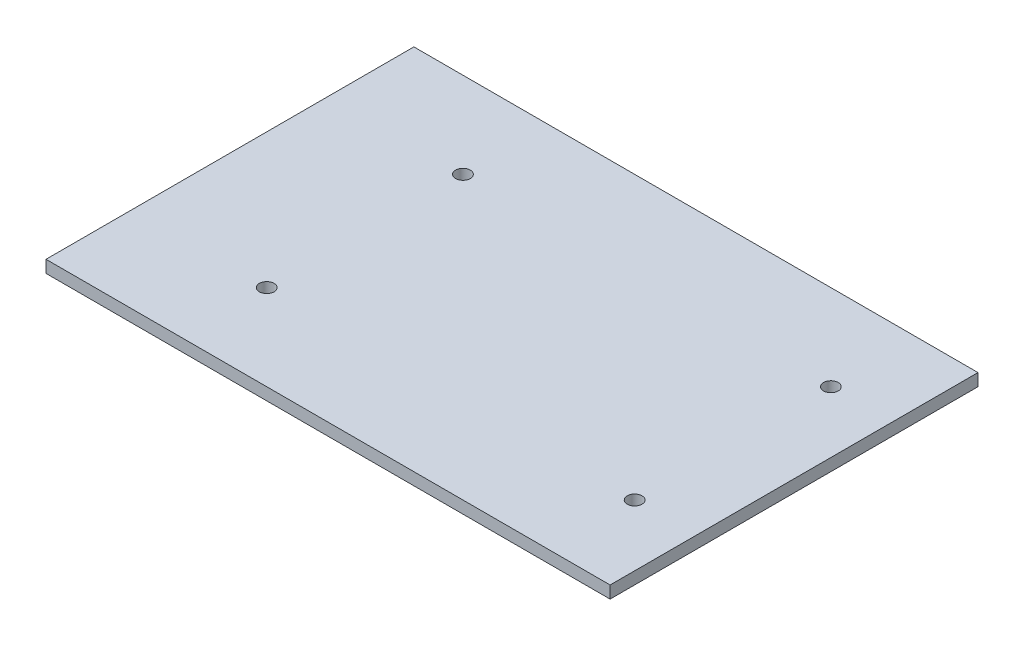
ISO-10303-21;
HEADER;
FILE_DESCRIPTION(('STEP AP214'),'2;1');
FILE_NAME('part.step','',(''),(''),'','','');
FILE_SCHEMA(('AUTOMOTIVE_DESIGN { 1 0 10303 214 1 1 1 1 }'));
ENDSEC;
DATA;
#1=APPLICATION_CONTEXT('core data for automotive mechanical design processes');
#2=APPLICATION_PROTOCOL_DEFINITION('international standard','automotive_design',2000,#1);
#3=PRODUCT_CONTEXT('',#1,'mechanical');
#4=PRODUCT('Part','Part','',(#3));
#5=PRODUCT_RELATED_PRODUCT_CATEGORY('part','',(#4));
#6=PRODUCT_DEFINITION_FORMATION('','',#4);
#7=PRODUCT_DEFINITION_CONTEXT('part definition',#1,'design');
#8=PRODUCT_DEFINITION('design','',#6,#7);
#9=PRODUCT_DEFINITION_SHAPE('','',#8);
#10=(LENGTH_UNIT() NAMED_UNIT(*) SI_UNIT(.MILLI.,.METRE.));
#11=(NAMED_UNIT(*) PLANE_ANGLE_UNIT() SI_UNIT($,.RADIAN.));
#12=(NAMED_UNIT(*) SI_UNIT($,.STERADIAN.) SOLID_ANGLE_UNIT());
#13=UNCERTAINTY_MEASURE_WITH_UNIT(LENGTH_MEASURE(1.E-05),#10,'distance_accuracy_value','');
#14=(GEOMETRIC_REPRESENTATION_CONTEXT(3) GLOBAL_UNCERTAINTY_ASSIGNED_CONTEXT((#13)) GLOBAL_UNIT_ASSIGNED_CONTEXT((#10,
#11,#12)) REPRESENTATION_CONTEXT('',''));
#15=CARTESIAN_POINT('',(0.,0.,0.));
#16=DIRECTION('',(0.,0.,1.));
#17=DIRECTION('',(1.,0.,0.));
#18=AXIS2_PLACEMENT_3D('',#15,#16,#17);
#19=CARTESIAN_POINT('',(0.,5.,0.));
#20=DIRECTION('',(1.,0.,0.));
#21=DIRECTION('',(0.,0.,-1.));
#22=AXIS2_PLACEMENT_3D('',#19,#20,#21);
#23=PLANE('',#22);
#24=DIRECTION('',(0.,0.,1.));
#25=VECTOR('',#24,1.);
#26=CARTESIAN_POINT('',(0.,0.,0.));
#27=LINE('',#26,#25);
#28=CARTESIAN_POINT('',(0.,0.,-150.));
#29=VERTEX_POINT('',#28);
#30=CARTESIAN_POINT('',(0.,0.,0.));
#31=VERTEX_POINT('',#30);
#32=EDGE_CURVE('E111',#29,#31,#27,.T.);
#33=ORIENTED_EDGE('',*,*,#32,.T.);
#34=DIRECTION('',(0.,-1.,0.));
#35=VECTOR('',#34,1.);
#36=CARTESIAN_POINT('',(0.,5.,0.));
#37=LINE('',#36,#35);
#38=CARTESIAN_POINT('',(0.,5.,0.));
#39=VERTEX_POINT('',#38);
#40=EDGE_CURVE('E11',#39,#31,#37,.T.);
#41=ORIENTED_EDGE('',*,*,#40,.F.);
#42=DIRECTION('',(0.,0.,1.));
#43=VECTOR('',#42,1.);
#44=CARTESIAN_POINT('',(0.,5.,0.));
#45=LINE('',#44,#43);
#46=CARTESIAN_POINT('',(0.,5.,-150.));
#47=VERTEX_POINT('',#46);
#48=EDGE_CURVE('E94',#47,#39,#45,.T.);
#49=ORIENTED_EDGE('',*,*,#48,.F.);
#50=DIRECTION('',(0.,-1.,0.));
#51=VECTOR('',#50,1.);
#52=CARTESIAN_POINT('',(0.,5.,-150.));
#53=LINE('',#52,#51);
#54=EDGE_CURVE('E107',#47,#29,#53,.T.);
#55=ORIENTED_EDGE('',*,*,#54,.T.);
#56=EDGE_LOOP('',(#33,#41,#49,#55));
#57=FACE_BOUND('',#56,.T.);
#58=ADVANCED_FACE('F40',(#57),#23,.F.);
#59=CARTESIAN_POINT('',(0.,5.,0.));
#60=DIRECTION('',(0.,0.,-1.));
#61=DIRECTION('',(-1.,0.,0.));
#62=AXIS2_PLACEMENT_3D('',#59,#60,#61);
#63=PLANE('',#62);
#64=DIRECTION('',(1.,0.,0.));
#65=VECTOR('',#64,1.);
#66=CARTESIAN_POINT('',(0.,0.,0.));
#67=LINE('',#66,#65);
#68=CARTESIAN_POINT('',(230.,0.,0.));
#69=VERTEX_POINT('',#68);
#70=EDGE_CURVE('E99',#31,#69,#67,.T.);
#71=ORIENTED_EDGE('',*,*,#70,.T.);
#72=DIRECTION('',(0.,-1.,0.));
#73=VECTOR('',#72,1.);
#74=CARTESIAN_POINT('',(230.,5.,0.));
#75=LINE('',#74,#73);
#76=CARTESIAN_POINT('',(230.,5.,0.));
#77=VERTEX_POINT('',#76);
#78=EDGE_CURVE('E50',#77,#69,#75,.T.);
#79=ORIENTED_EDGE('',*,*,#78,.F.);
#80=DIRECTION('',(1.,0.,0.));
#81=VECTOR('',#80,1.);
#82=CARTESIAN_POINT('',(0.,5.,0.));
#83=LINE('',#82,#81);
#84=EDGE_CURVE('E89',#39,#77,#83,.T.);
#85=ORIENTED_EDGE('',*,*,#84,.F.);
#86=ORIENTED_EDGE('',*,*,#40,.T.);
#87=EDGE_LOOP('',(#71,#79,#85,#86));
#88=FACE_BOUND('',#87,.T.);
#89=ADVANCED_FACE('F98',(#88),#63,.F.);
#90=CARTESIAN_POINT('',(230.,5.,0.));
#91=DIRECTION('',(-1.,0.,0.));
#92=DIRECTION('',(0.,0.,1.));
#93=AXIS2_PLACEMENT_3D('',#90,#91,#92);
#94=PLANE('',#93);
#95=DIRECTION('',(0.,0.,-1.));
#96=VECTOR('',#95,1.);
#97=CARTESIAN_POINT('',(230.,0.,0.));
#98=LINE('',#97,#96);
#99=CARTESIAN_POINT('',(230.,0.,-150.));
#100=VERTEX_POINT('',#99);
#101=EDGE_CURVE('E76',#69,#100,#98,.T.);
#102=ORIENTED_EDGE('',*,*,#101,.T.);
#103=DIRECTION('',(0.,-1.,0.));
#104=VECTOR('',#103,1.);
#105=CARTESIAN_POINT('',(230.,5.,-150.));
#106=LINE('',#105,#104);
#107=CARTESIAN_POINT('',(230.,5.,-150.));
#108=VERTEX_POINT('',#107);
#109=EDGE_CURVE('E101',#108,#100,#106,.T.);
#110=ORIENTED_EDGE('',*,*,#109,.F.);
#111=DIRECTION('',(0.,0.,-1.));
#112=VECTOR('',#111,1.);
#113=CARTESIAN_POINT('',(230.,5.,0.));
#114=LINE('',#113,#112);
#115=EDGE_CURVE('E92',#77,#108,#114,.T.);
#116=ORIENTED_EDGE('',*,*,#115,.F.);
#117=ORIENTED_EDGE('',*,*,#78,.T.);
#118=EDGE_LOOP('',(#102,#110,#116,#117));
#119=FACE_BOUND('',#118,.T.);
#120=ADVANCED_FACE('F103',(#119),#94,.F.);
#121=CARTESIAN_POINT('',(0.,5.,-150.));
#122=DIRECTION('',(0.,0.,1.));
#123=DIRECTION('',(1.,0.,0.));
#124=AXIS2_PLACEMENT_3D('',#121,#122,#123);
#125=PLANE('',#124);
#126=DIRECTION('',(-1.,0.,0.));
#127=VECTOR('',#126,1.);
#128=CARTESIAN_POINT('',(0.,0.,-150.));
#129=LINE('',#128,#127);
#130=EDGE_CURVE('E82',#100,#29,#129,.T.);
#131=ORIENTED_EDGE('',*,*,#130,.T.);
#132=ORIENTED_EDGE('',*,*,#54,.F.);
#133=DIRECTION('',(-1.,0.,0.));
#134=VECTOR('',#133,1.);
#135=CARTESIAN_POINT('',(0.,5.,-150.));
#136=LINE('',#135,#134);
#137=EDGE_CURVE('E59',#108,#47,#136,.T.);
#138=ORIENTED_EDGE('',*,*,#137,.F.);
#139=ORIENTED_EDGE('',*,*,#109,.T.);
#140=EDGE_LOOP('',(#131,#132,#138,#139));
#141=FACE_BOUND('',#140,.T.);
#142=ADVANCED_FACE('F164',(#141),#125,.F.);
#143=CARTESIAN_POINT('',(0.,5.,0.));
#144=DIRECTION('',(0.,-1.,0.));
#145=DIRECTION('',(0.,0.,-1.));
#146=AXIS2_PLACEMENT_3D('',#143,#144,#145);
#147=PLANE('',#146);
#148=CARTESIAN_POINT('',(55.,5.,-115.));
#149=DIRECTION('',(0.,1.,0.));
#150=DIRECTION('',(0.,0.,1.));
#151=AXIS2_PLACEMENT_3D('',#148,#149,#150);
#152=CIRCLE('',#151,3.);
#153=CARTESIAN_POINT('',(55.,5.,-112.));
#154=VERTEX_POINT('',#153);
#155=EDGE_CURVE('E128',#154,#154,#152,.T.);
#156=ORIENTED_EDGE('',*,*,#155,.F.);
#157=EDGE_LOOP('',(#156));
#158=FACE_BOUND('',#157,.T.);
#159=CARTESIAN_POINT('',(55.,5.,-35.));
#160=DIRECTION('',(0.,1.,0.));
#161=DIRECTION('',(0.,0.,1.));
#162=AXIS2_PLACEMENT_3D('',#159,#160,#161);
#163=CIRCLE('',#162,3.);
#164=CARTESIAN_POINT('',(55.,5.,-32.));
#165=VERTEX_POINT('',#164);
#166=EDGE_CURVE('E136',#165,#165,#163,.T.);
#167=ORIENTED_EDGE('',*,*,#166,.F.);
#168=EDGE_LOOP('',(#167));
#169=FACE_BOUND('',#168,.T.);
#170=CARTESIAN_POINT('',(205.,5.,-35.));
#171=DIRECTION('',(0.,1.,0.));
#172=DIRECTION('',(0.,0.,1.));
#173=AXIS2_PLACEMENT_3D('',#170,#171,#172);
#174=CIRCLE('',#173,2.99999999999999);
#175=CARTESIAN_POINT('',(205.,5.,-32.));
#176=VERTEX_POINT('',#175);
#177=EDGE_CURVE('E147',#176,#176,#174,.T.);
#178=ORIENTED_EDGE('',*,*,#177,.F.);
#179=EDGE_LOOP('',(#178));
#180=FACE_BOUND('',#179,.T.);
#181=CARTESIAN_POINT('',(205.,5.,-115.));
#182=DIRECTION('',(0.,1.,0.));
#183=DIRECTION('',(0.,0.,1.));
#184=AXIS2_PLACEMENT_3D('',#181,#182,#183);
#185=CIRCLE('',#184,2.99999999999999);
#186=CARTESIAN_POINT('',(205.,5.,-112.));
#187=VERTEX_POINT('',#186);
#188=EDGE_CURVE('E134',#187,#187,#185,.T.);
#189=ORIENTED_EDGE('',*,*,#188,.F.);
#190=EDGE_LOOP('',(#189));
#191=FACE_BOUND('',#190,.T.);
#192=ORIENTED_EDGE('',*,*,#48,.T.);
#193=ORIENTED_EDGE('',*,*,#84,.T.);
#194=ORIENTED_EDGE('',*,*,#115,.T.);
#195=ORIENTED_EDGE('',*,*,#137,.T.);
#196=EDGE_LOOP('',(#192,#193,#194,#195));
#197=FACE_BOUND('',#196,.T.);
#198=ADVANCED_FACE('F90',(#158,#169,#180,#191,#197),#147,.F.);
#199=CARTESIAN_POINT('',(0.,0.,0.));
#200=DIRECTION('',(0.,-1.,0.));
#201=DIRECTION('',(0.,0.,-1.));
#202=AXIS2_PLACEMENT_3D('',#199,#200,#201);
#203=PLANE('',#202);
#204=CARTESIAN_POINT('',(55.,0.,-115.));
#205=DIRECTION('',(0.,-1.,0.));
#206=DIRECTION('',(0.,0.,-1.));
#207=AXIS2_PLACEMENT_3D('',#204,#205,#206);
#208=CIRCLE('',#207,3.);
#209=CARTESIAN_POINT('',(55.,0.,-118.));
#210=VERTEX_POINT('',#209);
#211=EDGE_CURVE('E43',#210,#210,#208,.T.);
#212=ORIENTED_EDGE('',*,*,#211,.F.);
#213=EDGE_LOOP('',(#212));
#214=FACE_BOUND('',#213,.T.);
#215=CARTESIAN_POINT('',(55.,0.,-35.));
#216=DIRECTION('',(0.,-1.,0.));
#217=DIRECTION('',(0.,0.,-1.));
#218=AXIS2_PLACEMENT_3D('',#215,#216,#217);
#219=CIRCLE('',#218,3.);
#220=CARTESIAN_POINT('',(55.,0.,-38.));
#221=VERTEX_POINT('',#220);
#222=EDGE_CURVE('E125',#221,#221,#219,.T.);
#223=ORIENTED_EDGE('',*,*,#222,.F.);
#224=EDGE_LOOP('',(#223));
#225=FACE_BOUND('',#224,.T.);
#226=CARTESIAN_POINT('',(205.,0.,-35.));
#227=DIRECTION('',(0.,1.,0.));
#228=DIRECTION('',(0.,0.,1.));
#229=AXIS2_PLACEMENT_3D('',#226,#227,#228);
#230=CIRCLE('',#229,2.99999999999999);
#231=CARTESIAN_POINT('',(205.,0.,-32.));
#232=VERTEX_POINT('',#231);
#233=EDGE_CURVE('E115',#232,#232,#230,.T.);
#234=ORIENTED_EDGE('',*,*,#233,.T.);
#235=EDGE_LOOP('',(#234));
#236=FACE_BOUND('',#235,.T.);
#237=CARTESIAN_POINT('',(205.,0.,-115.));
#238=DIRECTION('',(0.,1.,0.));
#239=DIRECTION('',(0.,0.,1.));
#240=AXIS2_PLACEMENT_3D('',#237,#238,#239);
#241=CIRCLE('',#240,2.99999999999999);
#242=CARTESIAN_POINT('',(205.,0.,-112.));
#243=VERTEX_POINT('',#242);
#244=EDGE_CURVE('E151',#243,#243,#241,.T.);
#245=ORIENTED_EDGE('',*,*,#244,.T.);
#246=EDGE_LOOP('',(#245));
#247=FACE_BOUND('',#246,.T.);
#248=ORIENTED_EDGE('',*,*,#32,.F.);
#249=ORIENTED_EDGE('',*,*,#130,.F.);
#250=ORIENTED_EDGE('',*,*,#101,.F.);
#251=ORIENTED_EDGE('',*,*,#70,.F.);
#252=EDGE_LOOP('',(#248,#249,#250,#251));
#253=FACE_BOUND('',#252,.T.);
#254=ADVANCED_FACE('F163',(#214,#225,#236,#247,#253),#203,.T.);
#255=CARTESIAN_POINT('',(205.,0.,-115.));
#256=DIRECTION('',(0.,1.,0.));
#257=DIRECTION('',(0.,0.,1.));
#258=AXIS2_PLACEMENT_3D('',#255,#256,#257);
#259=CYLINDRICAL_SURFACE('',#258,2.99999999999999);
#260=ORIENTED_EDGE('',*,*,#244,.F.);
#261=EDGE_LOOP('',(#260));
#262=FACE_BOUND('',#261,.T.);
#263=ORIENTED_EDGE('',*,*,#188,.T.);
#264=EDGE_LOOP('',(#263));
#265=FACE_BOUND('',#264,.T.);
#266=ADVANCED_FACE('F160',(#262,#265),#259,.F.);
#267=CARTESIAN_POINT('',(205.,0.,-35.));
#268=DIRECTION('',(0.,1.,0.));
#269=DIRECTION('',(0.,0.,1.));
#270=AXIS2_PLACEMENT_3D('',#267,#268,#269);
#271=CYLINDRICAL_SURFACE('',#270,2.99999999999999);
#272=ORIENTED_EDGE('',*,*,#233,.F.);
#273=EDGE_LOOP('',(#272));
#274=FACE_BOUND('',#273,.T.);
#275=ORIENTED_EDGE('',*,*,#177,.T.);
#276=EDGE_LOOP('',(#275));
#277=FACE_BOUND('',#276,.T.);
#278=ADVANCED_FACE('F212',(#274,#277),#271,.F.);
#279=CARTESIAN_POINT('',(55.,-5.,-35.));
#280=DIRECTION('',(0.,1.,0.));
#281=DIRECTION('',(0.,0.,1.));
#282=AXIS2_PLACEMENT_3D('',#279,#280,#281);
#283=CYLINDRICAL_SURFACE('',#282,3.);
#284=ORIENTED_EDGE('',*,*,#222,.T.);
#285=EDGE_LOOP('',(#284));
#286=FACE_BOUND('',#285,.T.);
#287=ORIENTED_EDGE('',*,*,#166,.T.);
#288=EDGE_LOOP('',(#287));
#289=FACE_BOUND('',#288,.T.);
#290=ADVANCED_FACE('F217',(#286,#289),#283,.F.);
#291=CARTESIAN_POINT('',(55.,-5.,-115.));
#292=DIRECTION('',(0.,1.,0.));
#293=DIRECTION('',(0.,0.,1.));
#294=AXIS2_PLACEMENT_3D('',#291,#292,#293);
#295=CYLINDRICAL_SURFACE('',#294,3.);
#296=ORIENTED_EDGE('',*,*,#211,.T.);
#297=EDGE_LOOP('',(#296));
#298=FACE_BOUND('',#297,.T.);
#299=ORIENTED_EDGE('',*,*,#155,.T.);
#300=EDGE_LOOP('',(#299));
#301=FACE_BOUND('',#300,.T.);
#302=ADVANCED_FACE('F224',(#298,#301),#295,.F.);
#303=CLOSED_SHELL('',(#58,#89,#120,#142,#198,#254,#266,#278,#290,#302));
#304=MANIFOLD_SOLID_BREP('B2',#303);
#305=ADVANCED_BREP_SHAPE_REPRESENTATION('',(#18,#304),#14);
#306=SHAPE_DEFINITION_REPRESENTATION(#9,#305);
ENDSEC;
END-ISO-10303-21;
